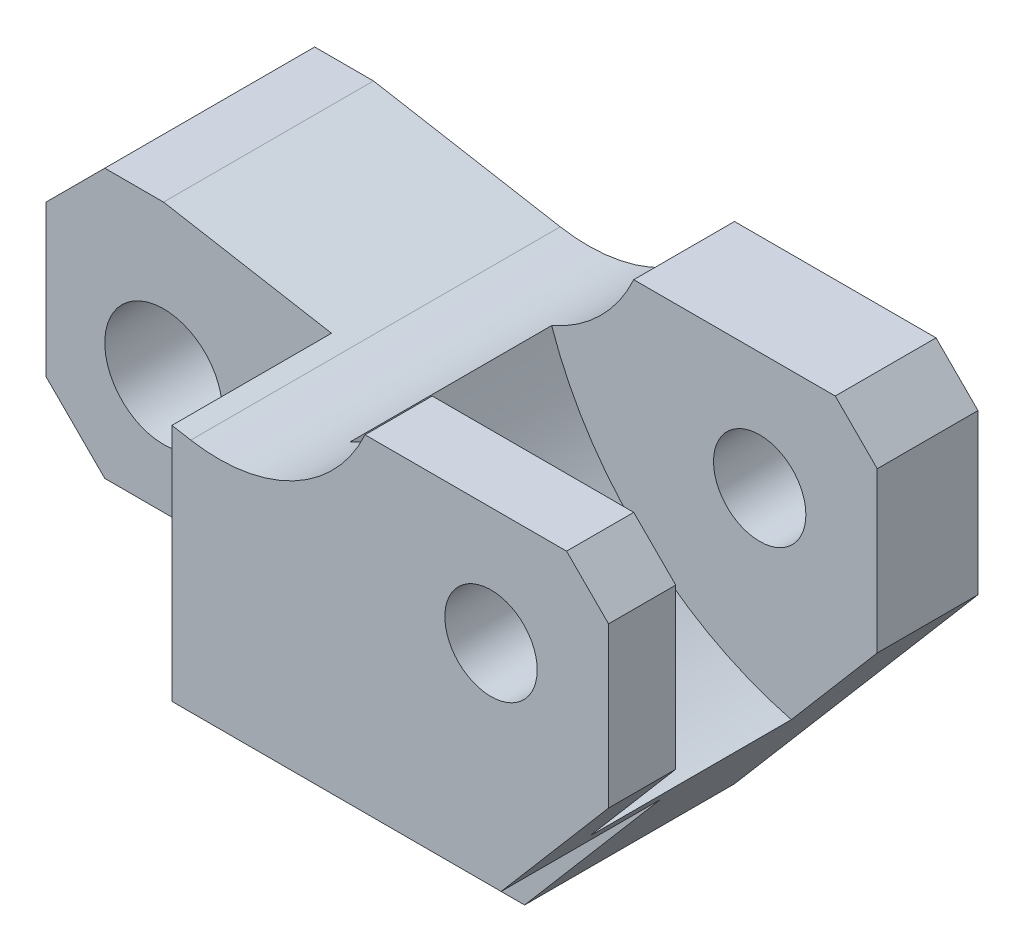
ISO-10303-21;
HEADER;
FILE_DESCRIPTION(('STEP AP214'),'2;1');
FILE_NAME('part.step','',(''),(''),'','','');
FILE_SCHEMA(('AUTOMOTIVE_DESIGN { 1 0 10303 214 1 1 1 1 }'));
ENDSEC;
DATA;
#1=APPLICATION_CONTEXT('core data for automotive mechanical design processes');
#2=APPLICATION_PROTOCOL_DEFINITION('international standard','automotive_design',2000,#1);
#3=PRODUCT_CONTEXT('',#1,'mechanical');
#4=PRODUCT('Part','Part','',(#3));
#5=PRODUCT_RELATED_PRODUCT_CATEGORY('part','',(#4));
#6=PRODUCT_DEFINITION_FORMATION('','',#4);
#7=PRODUCT_DEFINITION_CONTEXT('part definition',#1,'design');
#8=PRODUCT_DEFINITION('design','',#6,#7);
#9=PRODUCT_DEFINITION_SHAPE('','',#8);
#10=(LENGTH_UNIT() NAMED_UNIT(*) SI_UNIT(.MILLI.,.METRE.));
#11=(NAMED_UNIT(*) PLANE_ANGLE_UNIT() SI_UNIT($,.RADIAN.));
#12=(NAMED_UNIT(*) SI_UNIT($,.STERADIAN.) SOLID_ANGLE_UNIT());
#13=UNCERTAINTY_MEASURE_WITH_UNIT(LENGTH_MEASURE(1.E-05),#10,'distance_accuracy_value','');
#14=(GEOMETRIC_REPRESENTATION_CONTEXT(3) GLOBAL_UNCERTAINTY_ASSIGNED_CONTEXT((#13)) GLOBAL_UNIT_ASSIGNED_CONTEXT((#10,
#11,#12)) REPRESENTATION_CONTEXT('',''));
#15=CARTESIAN_POINT('',(0.,0.,0.));
#16=DIRECTION('',(0.,0.,1.));
#17=DIRECTION('',(1.,0.,0.));
#18=AXIS2_PLACEMENT_3D('',#15,#16,#17);
#19=CARTESIAN_POINT('',(57.,-19.,22.));
#20=DIRECTION('',(-0.760833951959086,0.64894660608275,0.));
#21=DIRECTION('',(-0.64894660608275,-0.760833951959086,0.));
#22=AXIS2_PLACEMENT_3D('',#19,#20,#21);
#23=PLANE('',#22);
#24=DIRECTION('',(-0.648946606082749,-0.760833951959086,0.));
#25=VECTOR('',#24,1.);
#26=CARTESIAN_POINT('',(75.764705882353,3.00000000000001,14.));
#27=LINE('',#26,#25);
#28=CARTESIAN_POINT('',(86.,15.,14.));
#29=VERTEX_POINT('',#28);
#30=CARTESIAN_POINT('',(75.764705882353,3.00000000000001,14.));
#31=VERTEX_POINT('',#30);
#32=EDGE_CURVE('E213',#29,#31,#27,.T.);
#33=ORIENTED_EDGE('',*,*,#32,.F.);
#34=DIRECTION('',(0.,0.,-1.));
#35=VECTOR('',#34,1.);
#36=CARTESIAN_POINT('',(86.,15.,22.));
#37=LINE('',#36,#35);
#38=CARTESIAN_POINT('',(86.,15.,22.));
#39=VERTEX_POINT('',#38);
#40=EDGE_CURVE('E380',#39,#29,#37,.T.);
#41=ORIENTED_EDGE('',*,*,#40,.F.);
#42=DIRECTION('',(0.64894660608275,0.760833951959086,0.));
#43=VECTOR('',#42,1.);
#44=CARTESIAN_POINT('',(57.,-19.,22.));
#45=LINE('',#44,#43);
#46=CARTESIAN_POINT('',(73.2058823529412,0.,22.));
#47=VERTEX_POINT('',#46);
#48=EDGE_CURVE('E297',#47,#39,#45,.T.);
#49=ORIENTED_EDGE('',*,*,#48,.F.);
#50=DIRECTION('',(0.,0.,-1.));
#51=VECTOR('',#50,1.);
#52=CARTESIAN_POINT('',(73.2058823529412,0.,22.));
#53=LINE('',#52,#51);
#54=CARTESIAN_POINT('',(73.2058823529412,0.,3.));
#55=VERTEX_POINT('',#54);
#56=EDGE_CURVE('E287',#47,#55,#53,.T.);
#57=ORIENTED_EDGE('',*,*,#56,.T.);
#58=DIRECTION('',(0.64894660608275,0.760833951959086,0.));
#59=VECTOR('',#58,1.);
#60=CARTESIAN_POINT('',(57.,-19.,3.));
#61=LINE('',#60,#59);
#62=CARTESIAN_POINT('',(57.,-19.,3.));
#63=VERTEX_POINT('',#62);
#64=EDGE_CURVE('E285',#63,#55,#61,.T.);
#65=ORIENTED_EDGE('',*,*,#64,.F.);
#66=DIRECTION('',(0.,0.,-1.));
#67=VECTOR('',#66,1.);
#68=CARTESIAN_POINT('',(57.,-19.,22.));
#69=LINE('',#68,#67);
#70=CARTESIAN_POINT('',(57.,-19.,-22.));
#71=VERTEX_POINT('',#70);
#72=EDGE_CURVE('E56',#63,#71,#69,.T.);
#73=ORIENTED_EDGE('',*,*,#72,.T.);
#74=DIRECTION('',(0.64894660608275,0.760833951959086,0.));
#75=VECTOR('',#74,1.);
#76=CARTESIAN_POINT('',(57.,-19.,-22.));
#77=LINE('',#76,#75);
#78=CARTESIAN_POINT('',(86.,15.,-22.));
#79=VERTEX_POINT('',#78);
#80=EDGE_CURVE('E319',#71,#79,#77,.T.);
#81=ORIENTED_EDGE('',*,*,#80,.T.);
#82=CARTESIAN_POINT('',(86.,15.,-10.));
#83=VERTEX_POINT('',#82);
#84=EDGE_CURVE('E379',#83,#79,#37,.T.);
#85=ORIENTED_EDGE('',*,*,#84,.F.);
#86=DIRECTION('',(-0.648946606082749,-0.760833951959086,0.));
#87=VECTOR('',#86,1.);
#88=CARTESIAN_POINT('',(75.764705882353,3.00000000000001,-10.));
#89=LINE('',#88,#87);
#90=CARTESIAN_POINT('',(75.764705882353,3.00000000000001,-10.));
#91=VERTEX_POINT('',#90);
#92=EDGE_CURVE('E222',#83,#91,#89,.T.);
#93=ORIENTED_EDGE('',*,*,#92,.T.);
#94=DIRECTION('',(0.,0.,-1.));
#95=VECTOR('',#94,1.);
#96=CARTESIAN_POINT('',(75.764705882353,3.00000000000001,14.));
#97=LINE('',#96,#95);
#98=EDGE_CURVE('E212',#31,#91,#97,.T.);
#99=ORIENTED_EDGE('',*,*,#98,.F.);
#100=EDGE_LOOP('',(#33,#41,#49,#57,#65,#73,#81,#85,#93,#99));
#101=FACE_BOUND('',#100,.T.);
#102=ADVANCED_FACE('F47',(#101),#23,.F.);
#103=CARTESIAN_POINT('',(86.,15.,22.));
#104=DIRECTION('',(-1.,0.,0.));
#105=DIRECTION('',(0.,-1.,0.));
#106=AXIS2_PLACEMENT_3D('',#103,#104,#105);
#107=PLANE('',#106);
#108=DIRECTION('',(0.,-1.,0.));
#109=VECTOR('',#108,1.);
#110=CARTESIAN_POINT('',(86.,15.,14.));
#111=LINE('',#110,#109);
#112=CARTESIAN_POINT('',(86.,34.,14.));
#113=VERTEX_POINT('',#112);
#114=EDGE_CURVE('E235',#113,#29,#111,.T.);
#115=ORIENTED_EDGE('',*,*,#114,.F.);
#116=DIRECTION('',(0.,0.,-1.));
#117=VECTOR('',#116,1.);
#118=CARTESIAN_POINT('',(86.,34.,22.));
#119=LINE('',#118,#117);
#120=CARTESIAN_POINT('',(86.,34.,22.));
#121=VERTEX_POINT('',#120);
#122=EDGE_CURVE('E376',#121,#113,#119,.T.);
#123=ORIENTED_EDGE('',*,*,#122,.F.);
#124=DIRECTION('',(0.,1.,0.));
#125=VECTOR('',#124,1.);
#126=CARTESIAN_POINT('',(86.,15.,22.));
#127=LINE('',#126,#125);
#128=EDGE_CURVE('E299',#39,#121,#127,.T.);
#129=ORIENTED_EDGE('',*,*,#128,.F.);
#130=ORIENTED_EDGE('',*,*,#40,.T.);
#131=EDGE_LOOP('',(#115,#123,#129,#130));
#132=FACE_BOUND('',#131,.T.);
#133=ADVANCED_FACE('F411',(#132),#107,.F.);
#134=CARTESIAN_POINT('',(86.,34.,22.));
#135=DIRECTION('',(-0.70710678118655,-0.707106781186545,0.));
#136=DIRECTION('',(0.707106781186545,-0.70710678118655,0.));
#137=AXIS2_PLACEMENT_3D('',#134,#135,#136);
#138=PLANE('',#137);
#139=DIRECTION('',(0.707106781186545,-0.70710678118655,0.));
#140=VECTOR('',#139,1.);
#141=CARTESIAN_POINT('',(86.,34.,14.));
#142=LINE('',#141,#140);
#143=CARTESIAN_POINT('',(81.,39.,14.));
#144=VERTEX_POINT('',#143);
#145=EDGE_CURVE('E231',#144,#113,#142,.T.);
#146=ORIENTED_EDGE('',*,*,#145,.F.);
#147=DIRECTION('',(0.,0.,-1.));
#148=VECTOR('',#147,1.);
#149=CARTESIAN_POINT('',(81.,39.,22.));
#150=LINE('',#149,#148);
#151=CARTESIAN_POINT('',(81.,39.,22.));
#152=VERTEX_POINT('',#151);
#153=EDGE_CURVE('E372',#152,#144,#150,.T.);
#154=ORIENTED_EDGE('',*,*,#153,.F.);
#155=DIRECTION('',(-0.707106781186545,0.70710678118655,0.));
#156=VECTOR('',#155,1.);
#157=CARTESIAN_POINT('',(86.,34.,22.));
#158=LINE('',#157,#156);
#159=EDGE_CURVE('E302',#121,#152,#158,.T.);
#160=ORIENTED_EDGE('',*,*,#159,.F.);
#161=ORIENTED_EDGE('',*,*,#122,.T.);
#162=EDGE_LOOP('',(#146,#154,#160,#161));
#163=FACE_BOUND('',#162,.T.);
#164=ADVANCED_FACE('F417',(#163),#138,.F.);
#165=CARTESIAN_POINT('',(81.,39.,22.));
#166=DIRECTION('',(0.,-1.,0.));
#167=DIRECTION('',(1.,0.,0.));
#168=AXIS2_PLACEMENT_3D('',#165,#166,#167);
#169=PLANE('',#168);
#170=DIRECTION('',(1.,0.,0.));
#171=VECTOR('',#170,1.);
#172=CARTESIAN_POINT('',(81.,39.,14.));
#173=LINE('',#172,#171);
#174=CARTESIAN_POINT('',(57.,39.,14.));
#175=VERTEX_POINT('',#174);
#176=EDGE_CURVE('E229',#175,#144,#173,.T.);
#177=ORIENTED_EDGE('',*,*,#176,.F.);
#178=DIRECTION('',(0.,0.,-1.));
#179=VECTOR('',#178,1.);
#180=CARTESIAN_POINT('',(57.,39.,22.));
#181=LINE('',#180,#179);
#182=CARTESIAN_POINT('',(57.,39.,22.));
#183=VERTEX_POINT('',#182);
#184=EDGE_CURVE('E228',#183,#175,#181,.T.);
#185=ORIENTED_EDGE('',*,*,#184,.F.);
#186=DIRECTION('',(-1.,0.,0.));
#187=VECTOR('',#186,1.);
#188=CARTESIAN_POINT('',(81.,39.,22.));
#189=LINE('',#188,#187);
#190=EDGE_CURVE('E304',#152,#183,#189,.T.);
#191=ORIENTED_EDGE('',*,*,#190,.F.);
#192=ORIENTED_EDGE('',*,*,#153,.T.);
#193=EDGE_LOOP('',(#177,#185,#191,#192));
#194=FACE_BOUND('',#193,.T.);
#195=ADVANCED_FACE('F404',(#194),#169,.F.);
#196=CARTESIAN_POINT('',(39.5718180126445,46.9366818530583,22.));
#197=DIRECTION('',(0.,0.,-1.));
#198=DIRECTION('',(-1.,0.,0.));
#199=AXIS2_PLACEMENT_3D('',#196,#197,#198);
#200=CYLINDRICAL_SURFACE('',#199,19.1502596906947);
#201=CARTESIAN_POINT('',(39.5718180126445,46.9366818530583,14.));
#202=DIRECTION('',(0.,0.,1.));
#203=DIRECTION('',(-1.,0.,0.));
#204=AXIS2_PLACEMENT_3D('',#201,#202,#203);
#205=CIRCLE('',#204,19.1502596906947);
#206=CARTESIAN_POINT('',(47.2240512084465,29.3817459848156,14.));
#207=VERTEX_POINT('',#206);
#208=EDGE_CURVE('E218',#207,#175,#205,.T.);
#209=ORIENTED_EDGE('',*,*,#208,.F.);
#210=DIRECTION('',(0.,0.,-1.));
#211=VECTOR('',#210,1.);
#212=CARTESIAN_POINT('',(47.2240512084465,29.3817459848156,14.));
#213=LINE('',#212,#211);
#214=CARTESIAN_POINT('',(47.2240512084465,29.3817459848156,-10.));
#215=VERTEX_POINT('',#214);
#216=EDGE_CURVE('E203',#207,#215,#213,.T.);
#217=ORIENTED_EDGE('',*,*,#216,.T.);
#218=CARTESIAN_POINT('',(39.5718180126445,46.9366818530583,-10.));
#219=DIRECTION('',(0.,0.,1.));
#220=DIRECTION('',(-1.,0.,0.));
#221=AXIS2_PLACEMENT_3D('',#218,#219,#220);
#222=CIRCLE('',#221,19.1502596906947);
#223=CARTESIAN_POINT('',(57.,39.,-10.));
#224=VERTEX_POINT('',#223);
#225=EDGE_CURVE('E239',#215,#224,#222,.T.);
#226=ORIENTED_EDGE('',*,*,#225,.T.);
#227=CARTESIAN_POINT('',(57.,39.,-22.));
#228=VERTEX_POINT('',#227);
#229=EDGE_CURVE('E369',#224,#228,#181,.T.);
#230=ORIENTED_EDGE('',*,*,#229,.T.);
#231=CARTESIAN_POINT('',(39.5718180126445,46.9366818530583,-22.));
#232=DIRECTION('',(0.,0.,-1.));
#233=DIRECTION('',(-1.,0.,0.));
#234=AXIS2_PLACEMENT_3D('',#231,#232,#233);
#235=CIRCLE('',#234,19.1502596906947);
#236=CARTESIAN_POINT('',(36.2464103155069,28.077357637465,-22.));
#237=VERTEX_POINT('',#236);
#238=EDGE_CURVE('E331',#228,#237,#235,.T.);
#239=ORIENTED_EDGE('',*,*,#238,.T.);
#240=DIRECTION('',(0.,0.,-1.));
#241=VECTOR('',#240,1.);
#242=CARTESIAN_POINT('',(36.2464103155069,28.077357637465,22.));
#243=LINE('',#242,#241);
#244=CARTESIAN_POINT('',(36.2464103155069,28.077357637465,22.));
#245=VERTEX_POINT('',#244);
#246=EDGE_CURVE('E366',#245,#237,#243,.T.);
#247=ORIENTED_EDGE('',*,*,#246,.F.);
#248=CARTESIAN_POINT('',(39.5718180126445,46.9366818530583,22.));
#249=DIRECTION('',(0.,0.,-1.));
#250=DIRECTION('',(-1.,0.,0.));
#251=AXIS2_PLACEMENT_3D('',#248,#249,#250);
#252=CIRCLE('',#251,19.1502596906947);
#253=EDGE_CURVE('E306',#183,#245,#252,.T.);
#254=ORIENTED_EDGE('',*,*,#253,.F.);
#255=ORIENTED_EDGE('',*,*,#184,.T.);
#256=EDGE_LOOP('',(#209,#217,#226,#230,#239,#247,#254,#255));
#257=FACE_BOUND('',#256,.T.);
#258=ADVANCED_FACE('F225',(#257),#200,.F.);
#259=CARTESIAN_POINT('',(72.,25.,-22.));
#260=DIRECTION('',(0.,0.,1.));
#261=DIRECTION('',(1.,0.,0.));
#262=AXIS2_PLACEMENT_3D('',#259,#260,#261);
#263=CYLINDRICAL_SURFACE('',#262,5.5);
#264=CARTESIAN_POINT('',(72.,25.,22.));
#265=DIRECTION('',(0.,0.,1.));
#266=DIRECTION('',(1.,0.,0.));
#267=AXIS2_PLACEMENT_3D('',#264,#265,#266);
#268=CIRCLE('',#267,5.5);
#269=CARTESIAN_POINT('',(77.5,25.,22.));
#270=VERTEX_POINT('',#269);
#271=EDGE_CURVE('E256',#270,#270,#268,.T.);
#272=ORIENTED_EDGE('',*,*,#271,.T.);
#273=EDGE_LOOP('',(#272));
#274=FACE_BOUND('',#273,.T.);
#275=CARTESIAN_POINT('',(72.,25.,14.));
#276=DIRECTION('',(0.,0.,-1.));
#277=DIRECTION('',(-1.,0.,0.));
#278=AXIS2_PLACEMENT_3D('',#275,#276,#277);
#279=CIRCLE('',#278,5.5);
#280=CARTESIAN_POINT('',(66.5,25.,14.));
#281=VERTEX_POINT('',#280);
#282=EDGE_CURVE('E51',#281,#281,#279,.F.);
#283=ORIENTED_EDGE('',*,*,#282,.F.);
#284=EDGE_LOOP('',(#283));
#285=FACE_BOUND('',#284,.T.);
#286=ADVANCED_FACE('F391',(#274,#285),#263,.F.);
#287=CARTESIAN_POINT('',(73.2058823529412,0.,22.));
#288=DIRECTION('',(0.,0.,-1.));
#289=DIRECTION('',(-1.,0.,0.));
#290=AXIS2_PLACEMENT_3D('',#287,#288,#289);
#291=CYLINDRICAL_SURFACE('',#290,29.);
#292=CARTESIAN_POINT('',(73.2058823529412,0.,3.));
#293=DIRECTION('',(0.,0.,1.));
#294=DIRECTION('',(1.,0.,0.));
#295=AXIS2_PLACEMENT_3D('',#292,#293,#294);
#296=CIRCLE('',#295,29.);
#297=CARTESIAN_POINT('',(44.5211776527525,-4.26470588235294,3.));
#298=VERTEX_POINT('',#297);
#299=CARTESIAN_POINT('',(51.2969800527345,-19.,3.));
#300=VERTEX_POINT('',#299);
#301=EDGE_CURVE('E276',#298,#300,#296,.T.);
#302=ORIENTED_EDGE('',*,*,#301,.F.);
#303=DIRECTION('',(0.,0.,-1.));
#304=VECTOR('',#303,1.);
#305=CARTESIAN_POINT('',(44.5211776527525,-4.26470588235294,22.));
#306=LINE('',#305,#304);
#307=CARTESIAN_POINT('',(44.5211776527525,-4.26470588235294,-22.));
#308=VERTEX_POINT('',#307);
#309=EDGE_CURVE('E313',#298,#308,#306,.T.);
#310=ORIENTED_EDGE('',*,*,#309,.T.);
#311=CARTESIAN_POINT('',(73.2058823529412,0.,-22.));
#312=DIRECTION('',(0.,0.,1.));
#313=DIRECTION('',(1.,0.,0.));
#314=AXIS2_PLACEMENT_3D('',#311,#312,#313);
#315=CIRCLE('',#314,29.);
#316=CARTESIAN_POINT('',(51.2969800527345,-19.,-22.));
#317=VERTEX_POINT('',#316);
#318=EDGE_CURVE('E296',#308,#317,#315,.T.);
#319=ORIENTED_EDGE('',*,*,#318,.T.);
#320=DIRECTION('',(0.,0.,-1.));
#321=VECTOR('',#320,1.);
#322=CARTESIAN_POINT('',(51.2969800527345,-19.,22.));
#323=LINE('',#322,#321);
#324=EDGE_CURVE('E11',#300,#317,#323,.T.);
#325=ORIENTED_EDGE('',*,*,#324,.F.);
#326=EDGE_LOOP('',(#302,#310,#319,#325));
#327=FACE_BOUND('',#326,.T.);
#328=ADVANCED_FACE('F49',(#327),#291,.T.);
#329=CARTESIAN_POINT('',(51.2969800527345,-19.,22.));
#330=DIRECTION('',(0.,1.,0.));
#331=DIRECTION('',(-1.,0.,0.));
#332=AXIS2_PLACEMENT_3D('',#329,#330,#331);
#333=PLANE('',#332);
#334=DIRECTION('',(1.,0.,0.));
#335=VECTOR('',#334,1.);
#336=CARTESIAN_POINT('',(0.,-19.,3.));
#337=LINE('',#336,#335);
#338=EDGE_CURVE('E266',#300,#63,#337,.T.);
#339=ORIENTED_EDGE('',*,*,#338,.F.);
#340=ORIENTED_EDGE('',*,*,#324,.T.);
#341=DIRECTION('',(1.,0.,0.));
#342=VECTOR('',#341,1.);
#343=CARTESIAN_POINT('',(51.2969800527345,-19.,-22.));
#344=LINE('',#343,#342);
#345=EDGE_CURVE('E316',#317,#71,#344,.T.);
#346=ORIENTED_EDGE('',*,*,#345,.T.);
#347=ORIENTED_EDGE('',*,*,#72,.F.);
#348=EDGE_LOOP('',(#339,#340,#346,#347));
#349=FACE_BOUND('',#348,.T.);
#350=ADVANCED_FACE('F401',(#349),#333,.F.);
#351=CARTESIAN_POINT('',(14.,32.,22.));
#352=DIRECTION('',(0.,-1.,0.));
#353=DIRECTION('',(0.,0.,-1.));
#354=AXIS2_PLACEMENT_3D('',#351,#352,#353);
#355=PLANE('',#354);
#356=DIRECTION('',(-1.,0.,0.));
#357=VECTOR('',#356,1.);
#358=CARTESIAN_POINT('',(34.,32.,3.));
#359=LINE('',#358,#357);
#360=CARTESIAN_POINT('',(14.,32.,3.));
#361=VERTEX_POINT('',#360);
#362=CARTESIAN_POINT('',(7.00000000000001,32.,3.));
#363=VERTEX_POINT('',#362);
#364=EDGE_CURVE('E262',#361,#363,#359,.T.);
#365=ORIENTED_EDGE('',*,*,#364,.F.);
#366=DIRECTION('',(0.,0.,-1.));
#367=VECTOR('',#366,1.);
#368=CARTESIAN_POINT('',(14.,32.,22.));
#369=LINE('',#368,#367);
#370=CARTESIAN_POINT('',(14.,32.,-22.));
#371=VERTEX_POINT('',#370);
#372=EDGE_CURVE('E364',#361,#371,#369,.T.);
#373=ORIENTED_EDGE('',*,*,#372,.T.);
#374=DIRECTION('',(-1.,0.,0.));
#375=VECTOR('',#374,1.);
#376=CARTESIAN_POINT('',(14.,32.,-22.));
#377=LINE('',#376,#375);
#378=CARTESIAN_POINT('',(7.,32.,-22.));
#379=VERTEX_POINT('',#378);
#380=EDGE_CURVE('E336',#371,#379,#377,.T.);
#381=ORIENTED_EDGE('',*,*,#380,.T.);
#382=DIRECTION('',(0.,0.,-1.));
#383=VECTOR('',#382,1.);
#384=CARTESIAN_POINT('',(7.,32.,22.));
#385=LINE('',#384,#383);
#386=EDGE_CURVE('E362',#363,#379,#385,.T.);
#387=ORIENTED_EDGE('',*,*,#386,.F.);
#388=EDGE_LOOP('',(#365,#373,#381,#387));
#389=FACE_BOUND('',#388,.T.);
#390=ADVANCED_FACE('F423',(#389),#355,.F.);
#391=CARTESIAN_POINT('',(7.,32.,22.));
#392=DIRECTION('',(0.707106781186547,-0.707106781186549,0.));
#393=DIRECTION('',(0.707106781186549,0.707106781186547,0.));
#394=AXIS2_PLACEMENT_3D('',#391,#392,#393);
#395=PLANE('',#394);
#396=DIRECTION('',(-0.707106781186549,-0.707106781186547,0.));
#397=VECTOR('',#396,1.);
#398=CARTESIAN_POINT('',(7.,32.,3.));
#399=LINE('',#398,#397);
#400=CARTESIAN_POINT('',(0.,25.,3.));
#401=VERTEX_POINT('',#400);
#402=EDGE_CURVE('E281',#363,#401,#399,.T.);
#403=ORIENTED_EDGE('',*,*,#402,.F.);
#404=ORIENTED_EDGE('',*,*,#386,.T.);
#405=DIRECTION('',(-0.707106781186548,-0.707106781186546,0.));
#406=VECTOR('',#405,1.);
#407=CARTESIAN_POINT('',(7.,32.,-22.));
#408=LINE('',#407,#406);
#409=CARTESIAN_POINT('',(0.,25.,-22.));
#410=VERTEX_POINT('',#409);
#411=EDGE_CURVE('E339',#379,#410,#408,.T.);
#412=ORIENTED_EDGE('',*,*,#411,.T.);
#413=DIRECTION('',(0.,0.,-1.));
#414=VECTOR('',#413,1.);
#415=CARTESIAN_POINT('',(0.,25.,22.));
#416=LINE('',#415,#414);
#417=EDGE_CURVE('E360',#401,#410,#416,.T.);
#418=ORIENTED_EDGE('',*,*,#417,.F.);
#419=EDGE_LOOP('',(#403,#404,#412,#418));
#420=FACE_BOUND('',#419,.T.);
#421=ADVANCED_FACE('F428',(#420),#395,.F.);
#422=CARTESIAN_POINT('',(0.,25.,22.));
#423=DIRECTION('',(1.,0.,0.));
#424=DIRECTION('',(0.,1.,0.));
#425=AXIS2_PLACEMENT_3D('',#422,#423,#424);
#426=PLANE('',#425);
#427=DIRECTION('',(0.,-1.,0.));
#428=VECTOR('',#427,1.);
#429=CARTESIAN_POINT('',(0.,32.,3.));
#430=LINE('',#429,#428);
#431=CARTESIAN_POINT('',(0.,7.00000000000001,3.));
#432=VERTEX_POINT('',#431);
#433=EDGE_CURVE('E264',#401,#432,#430,.T.);
#434=ORIENTED_EDGE('',*,*,#433,.F.);
#435=ORIENTED_EDGE('',*,*,#417,.T.);
#436=DIRECTION('',(0.,-1.,0.));
#437=VECTOR('',#436,1.);
#438=CARTESIAN_POINT('',(0.,25.,-22.));
#439=LINE('',#438,#437);
#440=CARTESIAN_POINT('',(0.,7.,-22.));
#441=VERTEX_POINT('',#440);
#442=EDGE_CURVE('E342',#410,#441,#439,.T.);
#443=ORIENTED_EDGE('',*,*,#442,.T.);
#444=DIRECTION('',(0.,0.,-1.));
#445=VECTOR('',#444,1.);
#446=CARTESIAN_POINT('',(0.,7.,22.));
#447=LINE('',#446,#445);
#448=EDGE_CURVE('E358',#432,#441,#447,.T.);
#449=ORIENTED_EDGE('',*,*,#448,.F.);
#450=EDGE_LOOP('',(#434,#435,#443,#449));
#451=FACE_BOUND('',#450,.T.);
#452=ADVANCED_FACE('F470',(#451),#426,.F.);
#453=CARTESIAN_POINT('',(0.,7.,22.));
#454=DIRECTION('',(0.707106781186549,0.707106781186547,0.));
#455=DIRECTION('',(-0.707106781186547,0.707106781186549,0.));
#456=AXIS2_PLACEMENT_3D('',#453,#454,#455);
#457=PLANE('',#456);
#458=DIRECTION('',(0.707106781186547,-0.707106781186549,0.));
#459=VECTOR('',#458,1.);
#460=CARTESIAN_POINT('',(0.,7.,3.));
#461=LINE('',#460,#459);
#462=CARTESIAN_POINT('',(6.99999999999998,0.,3.));
#463=VERTEX_POINT('',#462);
#464=EDGE_CURVE('E72',#432,#463,#461,.T.);
#465=ORIENTED_EDGE('',*,*,#464,.F.);
#466=ORIENTED_EDGE('',*,*,#448,.T.);
#467=DIRECTION('',(0.707106781186547,-0.707106781186548,0.));
#468=VECTOR('',#467,1.);
#469=CARTESIAN_POINT('',(0.,7.,-22.));
#470=LINE('',#469,#468);
#471=CARTESIAN_POINT('',(6.99999999999998,0.,-22.));
#472=VERTEX_POINT('',#471);
#473=EDGE_CURVE('E345',#441,#472,#470,.T.);
#474=ORIENTED_EDGE('',*,*,#473,.T.);
#475=DIRECTION('',(0.,0.,-1.));
#476=VECTOR('',#475,1.);
#477=CARTESIAN_POINT('',(6.99999999999998,0.,22.));
#478=LINE('',#477,#476);
#479=EDGE_CURVE('E356',#463,#472,#478,.T.);
#480=ORIENTED_EDGE('',*,*,#479,.F.);
#481=EDGE_LOOP('',(#465,#466,#474,#480));
#482=FACE_BOUND('',#481,.T.);
#483=ADVANCED_FACE('F461',(#482),#457,.F.);
#484=CARTESIAN_POINT('',(39.5755389113407,-5.,22.));
#485=DIRECTION('',(0.,0.,-1.));
#486=DIRECTION('',(-1.,0.,0.));
#487=AXIS2_PLACEMENT_3D('',#484,#485,#486);
#488=CYLINDRICAL_SURFACE('',#487,5.);
#489=CARTESIAN_POINT('',(39.5755389113407,-5.,3.));
#490=DIRECTION('',(0.,0.,1.));
#491=DIRECTION('',(1.,0.,0.));
#492=AXIS2_PLACEMENT_3D('',#489,#490,#491);
#493=CIRCLE('',#492,5.);
#494=CARTESIAN_POINT('',(39.5755389113407,0.,3.));
#495=VERTEX_POINT('',#494);
#496=EDGE_CURVE('E274',#495,#298,#493,.F.);
#497=ORIENTED_EDGE('',*,*,#496,.F.);
#498=DIRECTION('',(0.,0.,-1.));
#499=VECTOR('',#498,1.);
#500=CARTESIAN_POINT('',(39.5755389113407,0.,22.));
#501=LINE('',#500,#499);
#502=CARTESIAN_POINT('',(39.5755389113407,0.,-22.));
#503=VERTEX_POINT('',#502);
#504=EDGE_CURVE('E354',#495,#503,#501,.T.);
#505=ORIENTED_EDGE('',*,*,#504,.T.);
#506=CARTESIAN_POINT('',(39.5755389113407,-5.,-22.));
#507=DIRECTION('',(0.,0.,-1.));
#508=DIRECTION('',(-1.,0.,0.));
#509=AXIS2_PLACEMENT_3D('',#506,#507,#508);
#510=CIRCLE('',#509,5.);
#511=EDGE_CURVE('E300',#503,#308,#510,.T.);
#512=ORIENTED_EDGE('',*,*,#511,.T.);
#513=ORIENTED_EDGE('',*,*,#309,.F.);
#514=EDGE_LOOP('',(#497,#505,#512,#513));
#515=FACE_BOUND('',#514,.T.);
#516=ADVANCED_FACE('F458',(#515),#488,.F.);
#517=CARTESIAN_POINT('',(14.,14.,22.));
#518=DIRECTION('',(0.,0.,-1.));
#519=DIRECTION('',(-1.,0.,0.));
#520=AXIS2_PLACEMENT_3D('',#517,#518,#519);
#521=CYLINDRICAL_SURFACE('',#520,7.);
#522=CARTESIAN_POINT('',(14.,14.,-22.));
#523=DIRECTION('',(0.,0.,1.));
#524=DIRECTION('',(1.,0.,0.));
#525=AXIS2_PLACEMENT_3D('',#522,#523,#524);
#526=CIRCLE('',#525,7.);
#527=CARTESIAN_POINT('',(21.,14.,-22.));
#528=VERTEX_POINT('',#527);
#529=EDGE_CURVE('E293',#528,#528,#526,.T.);
#530=ORIENTED_EDGE('',*,*,#529,.F.);
#531=EDGE_LOOP('',(#530));
#532=FACE_BOUND('',#531,.T.);
#533=CARTESIAN_POINT('',(14.,14.,3.));
#534=DIRECTION('',(0.,0.,1.));
#535=DIRECTION('',(1.,0.,0.));
#536=AXIS2_PLACEMENT_3D('',#533,#534,#535);
#537=CIRCLE('',#536,7.);
#538=CARTESIAN_POINT('',(21.,14.,3.));
#539=VERTEX_POINT('',#538);
#540=EDGE_CURVE('E273',#539,#539,#537,.T.);
#541=ORIENTED_EDGE('',*,*,#540,.T.);
#542=EDGE_LOOP('',(#541));
#543=FACE_BOUND('',#542,.T.);
#544=ADVANCED_FACE('F460',(#532,#543),#521,.F.);
#545=CARTESIAN_POINT('',(73.2058823529412,0.,22.));
#546=DIRECTION('',(0.,0.,1.));
#547=DIRECTION('',(1.,0.,0.));
#548=AXIS2_PLACEMENT_3D('',#545,#546,#547);
#549=PLANE('',#548);
#550=ORIENTED_EDGE('',*,*,#271,.F.);
#551=EDGE_LOOP('',(#550));
#552=FACE_BOUND('',#551,.T.);
#553=DIRECTION('',(0.,1.,0.));
#554=VECTOR('',#553,1.);
#555=CARTESIAN_POINT('',(34.,0.,22.));
#556=LINE('',#555,#554);
#557=CARTESIAN_POINT('',(34.,0.,22.));
#558=VERTEX_POINT('',#557);
#559=CARTESIAN_POINT('',(34.,28.4734603858307,22.));
#560=VERTEX_POINT('',#559);
#561=EDGE_CURVE('E255',#558,#560,#556,.T.);
#562=ORIENTED_EDGE('',*,*,#561,.F.);
#563=DIRECTION('',(1.,0.,0.));
#564=VECTOR('',#563,1.);
#565=CARTESIAN_POINT('',(6.99999999999998,0.,22.));
#566=LINE('',#565,#564);
#567=EDGE_CURVE('E311',#558,#47,#566,.T.);
#568=ORIENTED_EDGE('',*,*,#567,.T.);
#569=ORIENTED_EDGE('',*,*,#48,.T.);
#570=ORIENTED_EDGE('',*,*,#128,.T.);
#571=ORIENTED_EDGE('',*,*,#159,.T.);
#572=ORIENTED_EDGE('',*,*,#190,.T.);
#573=ORIENTED_EDGE('',*,*,#253,.T.);
#574=DIRECTION('',(-0.984807753012208,0.173648177666931,0.));
#575=VECTOR('',#574,1.);
#576=CARTESIAN_POINT('',(36.2464103155069,28.077357637465,22.));
#577=LINE('',#576,#575);
#578=EDGE_CURVE('E308',#245,#560,#577,.T.);
#579=ORIENTED_EDGE('',*,*,#578,.T.);
#580=EDGE_LOOP('',(#562,#568,#569,#570,#571,#572,#573,#579));
#581=FACE_BOUND('',#580,.T.);
#582=ADVANCED_FACE('F467',(#552,#581),#549,.T.);
#583=CARTESIAN_POINT('',(73.2058823529412,0.,-22.));
#584=DIRECTION('',(0.,0.,1.));
#585=DIRECTION('',(1.,0.,0.));
#586=AXIS2_PLACEMENT_3D('',#583,#584,#585);
#587=PLANE('',#586);
#588=CARTESIAN_POINT('',(72.,25.,-22.));
#589=DIRECTION('',(0.,0.,1.));
#590=DIRECTION('',(1.,0.,0.));
#591=AXIS2_PLACEMENT_3D('',#588,#589,#590);
#592=CIRCLE('',#591,5.5);
#593=CARTESIAN_POINT('',(77.5,25.,-22.));
#594=VERTEX_POINT('',#593);
#595=EDGE_CURVE('E252',#594,#594,#592,.T.);
#596=ORIENTED_EDGE('',*,*,#595,.T.);
#597=EDGE_LOOP('',(#596));
#598=FACE_BOUND('',#597,.T.);
#599=ORIENTED_EDGE('',*,*,#318,.F.);
#600=ORIENTED_EDGE('',*,*,#511,.F.);
#601=DIRECTION('',(1.,0.,0.));
#602=VECTOR('',#601,1.);
#603=CARTESIAN_POINT('',(6.99999999999998,0.,-22.));
#604=LINE('',#603,#602);
#605=EDGE_CURVE('E348',#472,#503,#604,.T.);
#606=ORIENTED_EDGE('',*,*,#605,.F.);
#607=ORIENTED_EDGE('',*,*,#473,.F.);
#608=ORIENTED_EDGE('',*,*,#442,.F.);
#609=ORIENTED_EDGE('',*,*,#411,.F.);
#610=ORIENTED_EDGE('',*,*,#380,.F.);
#611=DIRECTION('',(-0.984807753012208,0.173648177666931,0.));
#612=VECTOR('',#611,1.);
#613=CARTESIAN_POINT('',(36.2464103155069,28.077357637465,-22.));
#614=LINE('',#613,#612);
#615=EDGE_CURVE('E333',#237,#371,#614,.T.);
#616=ORIENTED_EDGE('',*,*,#615,.F.);
#617=ORIENTED_EDGE('',*,*,#238,.F.);
#618=DIRECTION('',(-1.,0.,0.));
#619=VECTOR('',#618,1.);
#620=CARTESIAN_POINT('',(81.,39.,-22.));
#621=LINE('',#620,#619);
#622=CARTESIAN_POINT('',(81.,39.,-22.));
#623=VERTEX_POINT('',#622);
#624=EDGE_CURVE('E328',#623,#228,#621,.T.);
#625=ORIENTED_EDGE('',*,*,#624,.F.);
#626=DIRECTION('',(-0.707106781186545,0.70710678118655,0.));
#627=VECTOR('',#626,1.);
#628=CARTESIAN_POINT('',(86.,34.,-22.));
#629=LINE('',#628,#627);
#630=CARTESIAN_POINT('',(86.,34.,-22.));
#631=VERTEX_POINT('',#630);
#632=EDGE_CURVE('E325',#631,#623,#629,.T.);
#633=ORIENTED_EDGE('',*,*,#632,.F.);
#634=DIRECTION('',(0.,1.,0.));
#635=VECTOR('',#634,1.);
#636=CARTESIAN_POINT('',(86.,15.,-22.));
#637=LINE('',#636,#635);
#638=EDGE_CURVE('E322',#79,#631,#637,.T.);
#639=ORIENTED_EDGE('',*,*,#638,.F.);
#640=ORIENTED_EDGE('',*,*,#80,.F.);
#641=ORIENTED_EDGE('',*,*,#345,.F.);
#642=EDGE_LOOP('',(#599,#600,#606,#607,#608,#609,#610,#616,#617,#625,#633,#639,#640,#641));
#643=FACE_BOUND('',#642,.T.);
#644=ORIENTED_EDGE('',*,*,#529,.T.);
#645=EDGE_LOOP('',(#644));
#646=FACE_BOUND('',#645,.T.);
#647=ADVANCED_FACE('F442',(#598,#643,#646),#587,.F.);
#648=CARTESIAN_POINT('',(86.,34.,-10.));
#649=VERTEX_POINT('',#648);
#650=EDGE_CURVE('E375',#649,#631,#119,.T.);
#651=ORIENTED_EDGE('',*,*,#650,.F.);
#652=DIRECTION('',(0.,-1.,0.));
#653=VECTOR('',#652,1.);
#654=CARTESIAN_POINT('',(86.,15.,-10.));
#655=LINE('',#654,#653);
#656=EDGE_CURVE('E245',#649,#83,#655,.T.);
#657=ORIENTED_EDGE('',*,*,#656,.T.);
#658=ORIENTED_EDGE('',*,*,#84,.T.);
#659=ORIENTED_EDGE('',*,*,#638,.T.);
#660=EDGE_LOOP('',(#651,#657,#658,#659));
#661=FACE_BOUND('',#660,.T.);
#662=ADVANCED_FACE('F420',(#661),#107,.F.);
#663=CARTESIAN_POINT('',(81.,39.,-10.));
#664=VERTEX_POINT('',#663);
#665=EDGE_CURVE('E371',#664,#623,#150,.T.);
#666=ORIENTED_EDGE('',*,*,#665,.F.);
#667=DIRECTION('',(0.707106781186545,-0.70710678118655,0.));
#668=VECTOR('',#667,1.);
#669=CARTESIAN_POINT('',(86.,34.,-10.));
#670=LINE('',#669,#668);
#671=EDGE_CURVE('E242',#664,#649,#670,.T.);
#672=ORIENTED_EDGE('',*,*,#671,.T.);
#673=ORIENTED_EDGE('',*,*,#650,.T.);
#674=ORIENTED_EDGE('',*,*,#632,.T.);
#675=EDGE_LOOP('',(#666,#672,#673,#674));
#676=FACE_BOUND('',#675,.T.);
#677=ADVANCED_FACE('F491',(#676),#138,.F.);
#678=ORIENTED_EDGE('',*,*,#229,.F.);
#679=DIRECTION('',(1.,0.,0.));
#680=VECTOR('',#679,1.);
#681=CARTESIAN_POINT('',(81.,39.,-10.));
#682=LINE('',#681,#680);
#683=EDGE_CURVE('E64',#224,#664,#682,.T.);
#684=ORIENTED_EDGE('',*,*,#683,.T.);
#685=ORIENTED_EDGE('',*,*,#665,.T.);
#686=ORIENTED_EDGE('',*,*,#624,.T.);
#687=EDGE_LOOP('',(#678,#684,#685,#686));
#688=FACE_BOUND('',#687,.T.);
#689=ADVANCED_FACE('F487',(#688),#169,.F.);
#690=CARTESIAN_POINT('',(36.2464103155069,28.077357637465,22.));
#691=DIRECTION('',(-0.173648177666931,-0.984807753012208,0.));
#692=DIRECTION('',(0.984807753012208,-0.173648177666931,0.));
#693=AXIS2_PLACEMENT_3D('',#690,#691,#692);
#694=PLANE('',#693);
#695=DIRECTION('',(-0.984807753012208,0.173648177666931,0.));
#696=VECTOR('',#695,1.);
#697=CARTESIAN_POINT('',(36.2464103155069,28.077357637465,3.));
#698=LINE('',#697,#696);
#699=CARTESIAN_POINT('',(34.,28.4734603858307,3.));
#700=VERTEX_POINT('',#699);
#701=EDGE_CURVE('E283',#700,#361,#698,.T.);
#702=ORIENTED_EDGE('',*,*,#701,.F.);
#703=DIRECTION('',(0.,0.,1.));
#704=VECTOR('',#703,1.);
#705=CARTESIAN_POINT('',(34.,28.4734603858307,22.));
#706=LINE('',#705,#704);
#707=EDGE_CURVE('E290',#700,#560,#706,.T.);
#708=ORIENTED_EDGE('',*,*,#707,.T.);
#709=ORIENTED_EDGE('',*,*,#578,.F.);
#710=ORIENTED_EDGE('',*,*,#246,.T.);
#711=ORIENTED_EDGE('',*,*,#615,.T.);
#712=ORIENTED_EDGE('',*,*,#372,.F.);
#713=EDGE_LOOP('',(#702,#708,#709,#710,#711,#712));
#714=FACE_BOUND('',#713,.T.);
#715=ADVANCED_FACE('F478',(#714),#694,.F.);
#716=CARTESIAN_POINT('',(6.99999999999998,0.,22.));
#717=DIRECTION('',(0.,1.,0.));
#718=DIRECTION('',(-1.,0.,0.));
#719=AXIS2_PLACEMENT_3D('',#716,#717,#718);
#720=PLANE('',#719);
#721=ORIENTED_EDGE('',*,*,#567,.F.);
#722=DIRECTION('',(0.,0.,1.));
#723=VECTOR('',#722,1.);
#724=CARTESIAN_POINT('',(34.,0.,3.));
#725=LINE('',#724,#723);
#726=CARTESIAN_POINT('',(34.,0.,3.));
#727=VERTEX_POINT('',#726);
#728=EDGE_CURVE('E270',#727,#558,#725,.T.);
#729=ORIENTED_EDGE('',*,*,#728,.F.);
#730=DIRECTION('',(1.,0.,0.));
#731=VECTOR('',#730,1.);
#732=CARTESIAN_POINT('',(6.99999999999998,0.,3.));
#733=LINE('',#732,#731);
#734=EDGE_CURVE('E278',#463,#727,#733,.T.);
#735=ORIENTED_EDGE('',*,*,#734,.F.);
#736=ORIENTED_EDGE('',*,*,#479,.T.);
#737=ORIENTED_EDGE('',*,*,#605,.T.);
#738=ORIENTED_EDGE('',*,*,#504,.F.);
#739=DIRECTION('',(-1.,0.,0.));
#740=VECTOR('',#739,1.);
#741=CARTESIAN_POINT('',(86.,0.,3.));
#742=LINE('',#741,#740);
#743=EDGE_CURVE('E268',#55,#495,#742,.T.);
#744=ORIENTED_EDGE('',*,*,#743,.F.);
#745=ORIENTED_EDGE('',*,*,#56,.F.);
#746=EDGE_LOOP('',(#721,#729,#735,#736,#737,#738,#744,#745));
#747=FACE_BOUND('',#746,.T.);
#748=ADVANCED_FACE('F456',(#747),#720,.F.);
#749=CARTESIAN_POINT('',(0.,0.,3.));
#750=DIRECTION('',(0.,0.,1.));
#751=DIRECTION('',(1.,0.,0.));
#752=AXIS2_PLACEMENT_3D('',#749,#750,#751);
#753=PLANE('',#752);
#754=ORIENTED_EDGE('',*,*,#540,.F.);
#755=EDGE_LOOP('',(#754));
#756=FACE_BOUND('',#755,.T.);
#757=ORIENTED_EDGE('',*,*,#701,.T.);
#758=ORIENTED_EDGE('',*,*,#364,.T.);
#759=ORIENTED_EDGE('',*,*,#402,.T.);
#760=ORIENTED_EDGE('',*,*,#433,.T.);
#761=ORIENTED_EDGE('',*,*,#464,.T.);
#762=ORIENTED_EDGE('',*,*,#734,.T.);
#763=DIRECTION('',(0.,1.,0.));
#764=VECTOR('',#763,1.);
#765=CARTESIAN_POINT('',(34.,0.,3.));
#766=LINE('',#765,#764);
#767=EDGE_CURVE('E259',#727,#700,#766,.T.);
#768=ORIENTED_EDGE('',*,*,#767,.T.);
#769=EDGE_LOOP('',(#757,#758,#759,#760,#761,#762,#768));
#770=FACE_BOUND('',#769,.T.);
#771=ADVANCED_FACE('F477',(#756,#770),#753,.T.);
#772=CARTESIAN_POINT('',(34.,0.,3.));
#773=DIRECTION('',(1.,0.,0.));
#774=DIRECTION('',(0.,1.,0.));
#775=AXIS2_PLACEMENT_3D('',#772,#773,#774);
#776=PLANE('',#775);
#777=ORIENTED_EDGE('',*,*,#767,.F.);
#778=ORIENTED_EDGE('',*,*,#728,.T.);
#779=ORIENTED_EDGE('',*,*,#561,.T.);
#780=ORIENTED_EDGE('',*,*,#707,.F.);
#781=EDGE_LOOP('',(#777,#778,#779,#780));
#782=FACE_BOUND('',#781,.T.);
#783=ADVANCED_FACE('F531',(#782),#776,.F.);
#784=ORIENTED_EDGE('',*,*,#64,.T.);
#785=ORIENTED_EDGE('',*,*,#743,.T.);
#786=ORIENTED_EDGE('',*,*,#496,.T.);
#787=ORIENTED_EDGE('',*,*,#301,.T.);
#788=ORIENTED_EDGE('',*,*,#338,.T.);
#789=EDGE_LOOP('',(#784,#785,#786,#787,#788));
#790=FACE_BOUND('',#789,.T.);
#791=ADVANCED_FACE('F409',(#790),#753,.T.);
#792=CARTESIAN_POINT('',(72.,25.,-10.));
#793=DIRECTION('',(0.,0.,-1.));
#794=DIRECTION('',(-1.,0.,0.));
#795=AXIS2_PLACEMENT_3D('',#792,#793,#794);
#796=CIRCLE('',#795,5.5);
#797=CARTESIAN_POINT('',(66.5,25.,-10.));
#798=VERTEX_POINT('',#797);
#799=EDGE_CURVE('E250',#798,#798,#796,.F.);
#800=ORIENTED_EDGE('',*,*,#799,.T.);
#801=EDGE_LOOP('',(#800));
#802=FACE_BOUND('',#801,.T.);
#803=ORIENTED_EDGE('',*,*,#595,.F.);
#804=EDGE_LOOP('',(#803));
#805=FACE_BOUND('',#804,.T.);
#806=ADVANCED_FACE('F395',(#802,#805),#263,.F.);
#807=CARTESIAN_POINT('',(86.,42.7018734359634,14.));
#808=DIRECTION('',(0.,0.,-1.));
#809=DIRECTION('',(-1.,0.,0.));
#810=AXIS2_PLACEMENT_3D('',#807,#808,#809);
#811=PLANE('',#810);
#812=CARTESIAN_POINT('',(86.,42.7018734359634,14.));
#813=DIRECTION('',(0.,0.,-1.));
#814=DIRECTION('',(-1.,0.,0.));
#815=AXIS2_PLACEMENT_3D('',#812,#813,#814);
#816=CIRCLE('',#815,41.);
#817=EDGE_CURVE('E206',#31,#207,#816,.T.);
#818=ORIENTED_EDGE('',*,*,#817,.T.);
#819=ORIENTED_EDGE('',*,*,#208,.T.);
#820=ORIENTED_EDGE('',*,*,#176,.T.);
#821=ORIENTED_EDGE('',*,*,#145,.T.);
#822=ORIENTED_EDGE('',*,*,#114,.T.);
#823=ORIENTED_EDGE('',*,*,#32,.T.);
#824=EDGE_LOOP('',(#818,#819,#820,#821,#822,#823));
#825=FACE_BOUND('',#824,.T.);
#826=ORIENTED_EDGE('',*,*,#282,.T.);
#827=EDGE_LOOP('',(#826));
#828=FACE_BOUND('',#827,.T.);
#829=ADVANCED_FACE('F216',(#825,#828),#811,.T.);
#830=CARTESIAN_POINT('',(86.,42.7018734359634,-10.));
#831=DIRECTION('',(0.,0.,-1.));
#832=DIRECTION('',(-1.,0.,0.));
#833=AXIS2_PLACEMENT_3D('',#830,#831,#832);
#834=PLANE('',#833);
#835=CARTESIAN_POINT('',(86.,42.7018734359634,-10.));
#836=DIRECTION('',(0.,0.,-1.));
#837=DIRECTION('',(-1.,0.,0.));
#838=AXIS2_PLACEMENT_3D('',#835,#836,#837);
#839=CIRCLE('',#838,41.);
#840=EDGE_CURVE('E209',#91,#215,#839,.T.);
#841=ORIENTED_EDGE('',*,*,#840,.F.);
#842=ORIENTED_EDGE('',*,*,#92,.F.);
#843=ORIENTED_EDGE('',*,*,#656,.F.);
#844=ORIENTED_EDGE('',*,*,#671,.F.);
#845=ORIENTED_EDGE('',*,*,#683,.F.);
#846=ORIENTED_EDGE('',*,*,#225,.F.);
#847=EDGE_LOOP('',(#841,#842,#843,#844,#845,#846));
#848=FACE_BOUND('',#847,.T.);
#849=ORIENTED_EDGE('',*,*,#799,.F.);
#850=EDGE_LOOP('',(#849));
#851=FACE_BOUND('',#850,.T.);
#852=ADVANCED_FACE('F517',(#848,#851),#834,.F.);
#853=CARTESIAN_POINT('',(86.,42.7018734359634,14.));
#854=DIRECTION('',(0.,0.,-1.));
#855=DIRECTION('',(-1.,0.,0.));
#856=AXIS2_PLACEMENT_3D('',#853,#854,#855);
#857=CYLINDRICAL_SURFACE('',#856,41.);
#858=ORIENTED_EDGE('',*,*,#840,.T.);
#859=ORIENTED_EDGE('',*,*,#216,.F.);
#860=ORIENTED_EDGE('',*,*,#817,.F.);
#861=ORIENTED_EDGE('',*,*,#98,.T.);
#862=EDGE_LOOP('',(#858,#859,#860,#861));
#863=FACE_BOUND('',#862,.T.);
#864=ADVANCED_FACE('F205',(#863),#857,.F.);
#865=CLOSED_SHELL('',(#102,#133,#164,#195,#258,#286,#328,#350,#390,#421,#452,#483,#516,#544,
#582,#647,#662,#677,#689,#715,#748,#771,#783,#791,#806,#829,#852,#864));
#866=MANIFOLD_SOLID_BREP('B2',#865);
#867=ADVANCED_BREP_SHAPE_REPRESENTATION('',(#18,#866),#14);
#868=SHAPE_DEFINITION_REPRESENTATION(#9,#867);
ENDSEC;
END-ISO-10303-21;
